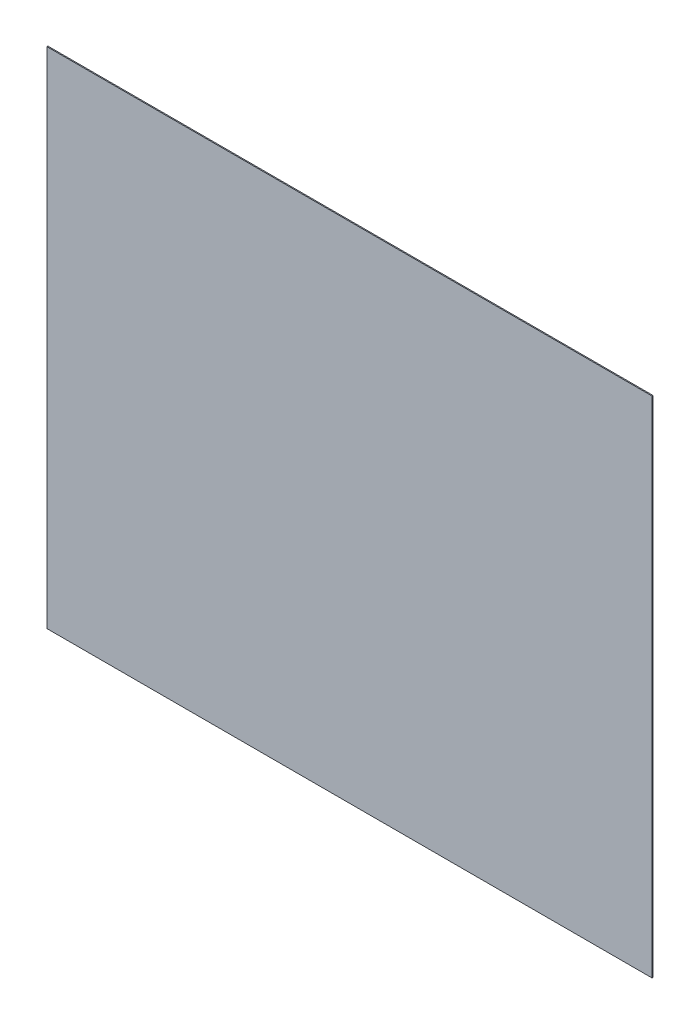
ISO-10303-21;
HEADER;
FILE_DESCRIPTION(('STEP AP214'),'2;1');
FILE_NAME('part.step','',(''),(''),'','','');
FILE_SCHEMA(('AUTOMOTIVE_DESIGN { 1 0 10303 214 1 1 1 1 }'));
ENDSEC;
DATA;
#1=APPLICATION_CONTEXT('core data for automotive mechanical design processes');
#2=APPLICATION_PROTOCOL_DEFINITION('international standard','automotive_design',2000,#1);
#3=PRODUCT_CONTEXT('',#1,'mechanical');
#4=PRODUCT('Part','Part','',(#3));
#5=PRODUCT_RELATED_PRODUCT_CATEGORY('part','',(#4));
#6=PRODUCT_DEFINITION_FORMATION('','',#4);
#7=PRODUCT_DEFINITION_CONTEXT('part definition',#1,'design');
#8=PRODUCT_DEFINITION('design','',#6,#7);
#9=PRODUCT_DEFINITION_SHAPE('','',#8);
#10=(LENGTH_UNIT() NAMED_UNIT(*) SI_UNIT(.MILLI.,.METRE.));
#11=(NAMED_UNIT(*) PLANE_ANGLE_UNIT() SI_UNIT($,.RADIAN.));
#12=(NAMED_UNIT(*) SI_UNIT($,.STERADIAN.) SOLID_ANGLE_UNIT());
#13=UNCERTAINTY_MEASURE_WITH_UNIT(LENGTH_MEASURE(1.E-05),#10,'distance_accuracy_value','');
#14=(GEOMETRIC_REPRESENTATION_CONTEXT(3) GLOBAL_UNCERTAINTY_ASSIGNED_CONTEXT((#13)) GLOBAL_UNIT_ASSIGNED_CONTEXT((#10,
#11,#12)) REPRESENTATION_CONTEXT('',''));
#15=CARTESIAN_POINT('',(0.,0.,0.));
#16=DIRECTION('',(0.,0.,1.));
#17=DIRECTION('',(1.,0.,0.));
#18=AXIS2_PLACEMENT_3D('',#15,#16,#17);
#19=CARTESIAN_POINT('',(-2.031834982752E-05,1.050183981015E-05,0.00100076));
#20=DIRECTION('',(0.,0.,1.));
#21=DIRECTION('',(1.,0.,0.));
#22=AXIS2_PLACEMENT_3D('',#19,#20,#21);
#23=PLANE('',#22);
#24=DIRECTION('',(1.,0.,0.));
#25=VECTOR('',#24,1.);
#26=CARTESIAN_POINT('',(-0.30055312,-0.25021794,0.00100076));
#27=LINE('',#26,#25);
#28=CARTESIAN_POINT('',(-0.30055312,-0.25021794,0.00100076));
#29=VERTEX_POINT('',#28);
#30=CARTESIAN_POINT('',(0.30047184,-0.25021794,0.00100076));
#31=VERTEX_POINT('',#30);
#32=EDGE_CURVE('E79',#29,#31,#27,.T.);
#33=ORIENTED_EDGE('',*,*,#32,.T.);
#34=DIRECTION('',(0.000162417583600343,0.999999986810264,0.));
#35=VECTOR('',#34,1.);
#36=CARTESIAN_POINT('',(0.30047184,-0.25021794,0.00100076));
#37=LINE('',#36,#35);
#38=CARTESIAN_POINT('',(0.30055312,0.25022048,0.00100076));
#39=VERTEX_POINT('',#38);
#40=EDGE_CURVE('E106',#31,#39,#37,.T.);
#41=ORIENTED_EDGE('',*,*,#40,.T.);
#42=DIRECTION('',(-1.,0.,0.));
#43=VECTOR('',#42,1.);
#44=CARTESIAN_POINT('',(0.30055312,0.25022048,0.00100076));
#45=LINE('',#44,#43);
#46=CARTESIAN_POINT('',(-0.30055312,0.25022048,0.00100076));
#47=VERTEX_POINT('',#46);
#48=EDGE_CURVE('E72',#39,#47,#45,.T.);
#49=ORIENTED_EDGE('',*,*,#48,.T.);
#50=DIRECTION('',(0.,-1.,0.));
#51=VECTOR('',#50,1.);
#52=CARTESIAN_POINT('',(-0.30055312,0.25022048,0.00100076));
#53=LINE('',#52,#51);
#54=EDGE_CURVE('E11',#47,#29,#53,.T.);
#55=ORIENTED_EDGE('',*,*,#54,.T.);
#56=EDGE_LOOP('',(#33,#41,#49,#55));
#57=FACE_BOUND('',#56,.T.);
#58=ADVANCED_FACE('F17',(#57),#23,.T.);
#59=CARTESIAN_POINT('',(-2.031834982752E-05,1.050183981015E-05,0.));
#60=DIRECTION('',(0.,0.,1.));
#61=DIRECTION('',(1.,0.,0.));
#62=AXIS2_PLACEMENT_3D('',#59,#60,#61);
#63=PLANE('',#62);
#64=DIRECTION('',(0.,-1.,0.));
#65=VECTOR('',#64,1.);
#66=CARTESIAN_POINT('',(-0.30055312,0.25022048,0.));
#67=LINE('',#66,#65);
#68=CARTESIAN_POINT('',(-0.30055312,0.25022048,0.));
#69=VERTEX_POINT('',#68);
#70=CARTESIAN_POINT('',(-0.30055312,-0.25021794,0.));
#71=VERTEX_POINT('',#70);
#72=EDGE_CURVE('E26',#69,#71,#67,.T.);
#73=ORIENTED_EDGE('',*,*,#72,.F.);
#74=DIRECTION('',(-1.,0.,0.));
#75=VECTOR('',#74,1.);
#76=CARTESIAN_POINT('',(0.30055312,0.25022048,0.));
#77=LINE('',#76,#75);
#78=CARTESIAN_POINT('',(0.30055312,0.25022048,0.));
#79=VERTEX_POINT('',#78);
#80=EDGE_CURVE('E97',#79,#69,#77,.T.);
#81=ORIENTED_EDGE('',*,*,#80,.F.);
#82=DIRECTION('',(0.000162417583600343,0.999999986810264,0.));
#83=VECTOR('',#82,1.);
#84=CARTESIAN_POINT('',(0.30047184,-0.25021794,0.));
#85=LINE('',#84,#83);
#86=CARTESIAN_POINT('',(0.30047184,-0.25021794,0.));
#87=VERTEX_POINT('',#86);
#88=EDGE_CURVE('E81',#87,#79,#85,.T.);
#89=ORIENTED_EDGE('',*,*,#88,.F.);
#90=DIRECTION('',(1.,0.,0.));
#91=VECTOR('',#90,1.);
#92=CARTESIAN_POINT('',(-0.30055312,-0.25021794,0.));
#93=LINE('',#92,#91);
#94=EDGE_CURVE('E77',#71,#87,#93,.T.);
#95=ORIENTED_EDGE('',*,*,#94,.F.);
#96=EDGE_LOOP('',(#73,#81,#89,#95));
#97=FACE_BOUND('',#96,.T.);
#98=ADVANCED_FACE('F83',(#97),#63,.F.);
#99=CARTESIAN_POINT('',(-0.30055312,0.25022048,0.));
#100=DIRECTION('',(1.,0.,0.));
#101=DIRECTION('',(0.,1.,0.));
#102=AXIS2_PLACEMENT_3D('',#99,#100,#101);
#103=PLANE('',#102);
#104=ORIENTED_EDGE('',*,*,#72,.T.);
#105=DIRECTION('',(0.,0.,1.));
#106=VECTOR('',#105,1.);
#107=CARTESIAN_POINT('',(-0.30055312,-0.25021794,0.));
#108=LINE('',#107,#106);
#109=EDGE_CURVE('E64',#71,#29,#108,.T.);
#110=ORIENTED_EDGE('',*,*,#109,.T.);
#111=ORIENTED_EDGE('',*,*,#54,.F.);
#112=DIRECTION('',(0.,0.,1.));
#113=VECTOR('',#112,1.);
#114=CARTESIAN_POINT('',(-0.30055312,0.25022048,0.));
#115=LINE('',#114,#113);
#116=EDGE_CURVE('E67',#69,#47,#115,.T.);
#117=ORIENTED_EDGE('',*,*,#116,.F.);
#118=EDGE_LOOP('',(#104,#110,#111,#117));
#119=FACE_BOUND('',#118,.T.);
#120=ADVANCED_FACE('F63',(#119),#103,.F.);
#121=CARTESIAN_POINT('',(0.30055312,0.25022048,0.));
#122=DIRECTION('',(0.,-1.,0.));
#123=DIRECTION('',(0.,0.,-1.));
#124=AXIS2_PLACEMENT_3D('',#121,#122,#123);
#125=PLANE('',#124);
#126=ORIENTED_EDGE('',*,*,#80,.T.);
#127=ORIENTED_EDGE('',*,*,#116,.T.);
#128=ORIENTED_EDGE('',*,*,#48,.F.);
#129=DIRECTION('',(0.,0.,1.));
#130=VECTOR('',#129,1.);
#131=CARTESIAN_POINT('',(0.30055312,0.25022048,0.));
#132=LINE('',#131,#130);
#133=EDGE_CURVE('E102',#79,#39,#132,.T.);
#134=ORIENTED_EDGE('',*,*,#133,.F.);
#135=EDGE_LOOP('',(#126,#127,#128,#134));
#136=FACE_BOUND('',#135,.T.);
#137=ADVANCED_FACE('F114',(#136),#125,.F.);
#138=CARTESIAN_POINT('',(0.30047184,-0.25021794,0.));
#139=DIRECTION('',(-0.999999986810264,0.000162417583600343,0.));
#140=DIRECTION('',(0.,0.,1.));
#141=AXIS2_PLACEMENT_3D('',#138,#139,#140);
#142=PLANE('',#141);
#143=ORIENTED_EDGE('',*,*,#88,.T.);
#144=ORIENTED_EDGE('',*,*,#133,.T.);
#145=ORIENTED_EDGE('',*,*,#40,.F.);
#146=DIRECTION('',(0.,0.,1.));
#147=VECTOR('',#146,1.);
#148=CARTESIAN_POINT('',(0.30047184,-0.25021794,0.));
#149=LINE('',#148,#147);
#150=EDGE_CURVE('E87',#87,#31,#149,.T.);
#151=ORIENTED_EDGE('',*,*,#150,.F.);
#152=EDGE_LOOP('',(#143,#144,#145,#151));
#153=FACE_BOUND('',#152,.T.);
#154=ADVANCED_FACE('F116',(#153),#142,.F.);
#155=CARTESIAN_POINT('',(-0.30055312,-0.25021794,0.));
#156=DIRECTION('',(0.,1.,0.));
#157=DIRECTION('',(1.,0.,0.));
#158=AXIS2_PLACEMENT_3D('',#155,#156,#157);
#159=PLANE('',#158);
#160=ORIENTED_EDGE('',*,*,#94,.T.);
#161=ORIENTED_EDGE('',*,*,#150,.T.);
#162=ORIENTED_EDGE('',*,*,#32,.F.);
#163=ORIENTED_EDGE('',*,*,#109,.F.);
#164=EDGE_LOOP('',(#160,#161,#162,#163));
#165=FACE_BOUND('',#164,.T.);
#166=ADVANCED_FACE('F75',(#165),#159,.F.);
#167=CLOSED_SHELL('',(#58,#98,#120,#137,#154,#166));
#168=MANIFOLD_SOLID_BREP('B1',#167);
#169=ADVANCED_BREP_SHAPE_REPRESENTATION('',(#18,#168),#14);
#170=SHAPE_DEFINITION_REPRESENTATION(#9,#169);
ENDSEC;
END-ISO-10303-21;
